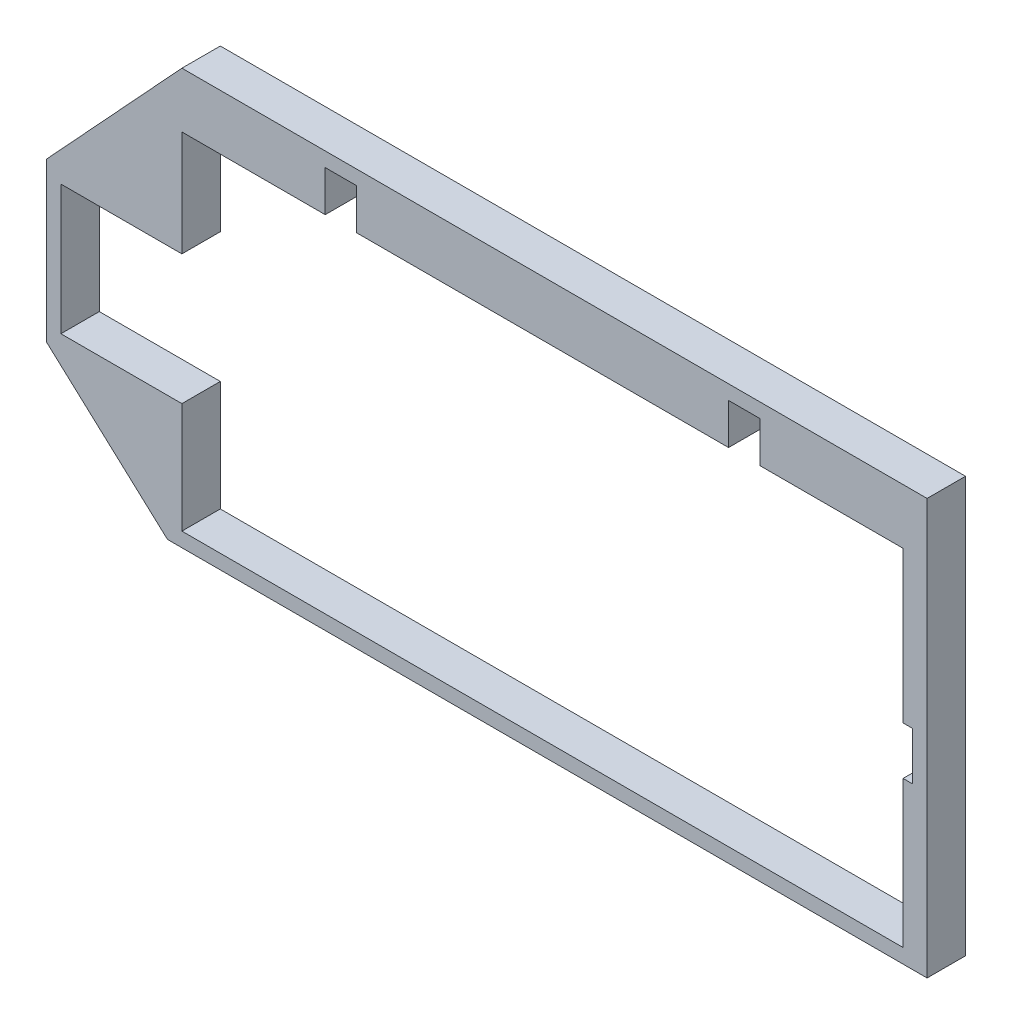
ISO-10303-21;
HEADER;
FILE_DESCRIPTION(('STEP AP214'),'2;1');
FILE_NAME('part.step','',(''),(''),'','','');
FILE_SCHEMA(('AUTOMOTIVE_DESIGN { 1 0 10303 214 1 1 1 1 }'));
ENDSEC;
DATA;
#1=APPLICATION_CONTEXT('core data for automotive mechanical design processes');
#2=APPLICATION_PROTOCOL_DEFINITION('international standard','automotive_design',2000,#1);
#3=PRODUCT_CONTEXT('',#1,'mechanical');
#4=PRODUCT('Part','Part','',(#3));
#5=PRODUCT_RELATED_PRODUCT_CATEGORY('part','',(#4));
#6=PRODUCT_DEFINITION_FORMATION('','',#4);
#7=PRODUCT_DEFINITION_CONTEXT('part definition',#1,'design');
#8=PRODUCT_DEFINITION('design','',#6,#7);
#9=PRODUCT_DEFINITION_SHAPE('','',#8);
#10=(LENGTH_UNIT() NAMED_UNIT(*) SI_UNIT(.MILLI.,.METRE.));
#11=(NAMED_UNIT(*) PLANE_ANGLE_UNIT() SI_UNIT($,.RADIAN.));
#12=(NAMED_UNIT(*) SI_UNIT($,.STERADIAN.) SOLID_ANGLE_UNIT());
#13=UNCERTAINTY_MEASURE_WITH_UNIT(LENGTH_MEASURE(1.E-05),#10,'distance_accuracy_value','');
#14=(GEOMETRIC_REPRESENTATION_CONTEXT(3) GLOBAL_UNCERTAINTY_ASSIGNED_CONTEXT((#13)) GLOBAL_UNIT_ASSIGNED_CONTEXT((#10,
#11,#12)) REPRESENTATION_CONTEXT('',''));
#15=CARTESIAN_POINT('',(0.,0.,0.));
#16=DIRECTION('',(0.,0.,1.));
#17=DIRECTION('',(1.,0.,0.));
#18=AXIS2_PLACEMENT_3D('',#15,#16,#17);
#19=CARTESIAN_POINT('',(0.,0.,8.));
#20=DIRECTION('',(0.,0.,1.));
#21=DIRECTION('',(1.,0.,0.));
#22=AXIS2_PLACEMENT_3D('',#19,#20,#21);
#23=PLANE('',#22);
#24=DIRECTION('',(-1.,0.,0.));
#25=VECTOR('',#24,1.);
#26=CARTESIAN_POINT('',(-150.2,83.5,8.));
#27=LINE('',#26,#25);
#28=CARTESIAN_POINT('',(5.,83.5,8.));
#29=VERTEX_POINT('',#28);
#30=CARTESIAN_POINT('',(-150.2,83.5,8.));
#31=VERTEX_POINT('',#30);
#32=EDGE_CURVE('E361',#29,#31,#27,.T.);
#33=ORIENTED_EDGE('',*,*,#32,.T.);
#34=DIRECTION('',(-0.678879797641086,-0.734249426526707,0.));
#35=VECTOR('',#34,1.);
#36=CARTESIAN_POINT('',(-178.4,53.,8.));
#37=LINE('',#36,#35);
#38=CARTESIAN_POINT('',(-178.4,53.,8.));
#39=VERTEX_POINT('',#38);
#40=EDGE_CURVE('E364',#31,#39,#37,.T.);
#41=ORIENTED_EDGE('',*,*,#40,.T.);
#42=DIRECTION('',(0.,-1.,0.));
#43=VECTOR('',#42,1.);
#44=CARTESIAN_POINT('',(-178.4,20.,8.));
#45=LINE('',#44,#43);
#46=CARTESIAN_POINT('',(-178.4,20.,8.));
#47=VERTEX_POINT('',#46);
#48=EDGE_CURVE('E367',#39,#47,#45,.T.);
#49=ORIENTED_EDGE('',*,*,#48,.T.);
#50=DIRECTION('',(0.738612390192779,-0.67413035612833,0.));
#51=VECTOR('',#50,1.);
#52=CARTESIAN_POINT('',(-178.4,20.,8.));
#53=LINE('',#52,#51);
#54=CARTESIAN_POINT('',(-153.2,-3.00000000000002,8.));
#55=VERTEX_POINT('',#54);
#56=EDGE_CURVE('E369',#47,#55,#53,.T.);
#57=ORIENTED_EDGE('',*,*,#56,.T.);
#58=DIRECTION('',(1.,0.,0.));
#59=VECTOR('',#58,1.);
#60=CARTESIAN_POINT('',(5.,-3.,8.));
#61=LINE('',#60,#59);
#62=CARTESIAN_POINT('',(5.,-3.,8.));
#63=VERTEX_POINT('',#62);
#64=EDGE_CURVE('E371',#55,#63,#61,.T.);
#65=ORIENTED_EDGE('',*,*,#64,.T.);
#66=DIRECTION('',(0.,1.,0.));
#67=VECTOR('',#66,1.);
#68=CARTESIAN_POINT('',(5.,-3.,8.));
#69=LINE('',#68,#67);
#70=EDGE_CURVE('E373',#63,#29,#69,.T.);
#71=ORIENTED_EDGE('',*,*,#70,.T.);
#72=EDGE_LOOP('',(#33,#41,#49,#57,#65,#71));
#73=FACE_BOUND('',#72,.T.);
#74=DIRECTION('',(-1.,0.,0.));
#75=VECTOR('',#74,1.);
#76=CARTESIAN_POINT('',(-150.2,50.,8.));
#77=LINE('',#76,#75);
#78=CARTESIAN_POINT('',(-150.2,50.,8.));
#79=VERTEX_POINT('',#78);
#80=CARTESIAN_POINT('',(-175.4,50.,8.));
#81=VERTEX_POINT('',#80);
#82=EDGE_CURVE('E220',#79,#81,#77,.T.);
#83=ORIENTED_EDGE('',*,*,#82,.F.);
#84=DIRECTION('',(0.,-1.,0.));
#85=VECTOR('',#84,1.);
#86=CARTESIAN_POINT('',(-150.2,72.,8.));
#87=LINE('',#86,#85);
#88=CARTESIAN_POINT('',(-150.2,72.,8.));
#89=VERTEX_POINT('',#88);
#90=EDGE_CURVE('E212',#89,#79,#87,.T.);
#91=ORIENTED_EDGE('',*,*,#90,.F.);
#92=DIRECTION('',(-1.,0.,0.));
#93=VECTOR('',#92,1.);
#94=CARTESIAN_POINT('',(-150.2,72.,8.));
#95=LINE('',#94,#93);
#96=CARTESIAN_POINT('',(-120.35,72.,8.));
#97=VERTEX_POINT('',#96);
#98=EDGE_CURVE('E269',#97,#89,#95,.T.);
#99=ORIENTED_EDGE('',*,*,#98,.F.);
#100=DIRECTION('',(0.,-1.,0.));
#101=VECTOR('',#100,1.);
#102=CARTESIAN_POINT('',(-120.35,72.,8.));
#103=LINE('',#102,#101);
#104=CARTESIAN_POINT('',(-120.35,80.5,8.));
#105=VERTEX_POINT('',#104);
#106=EDGE_CURVE('E267',#105,#97,#103,.T.);
#107=ORIENTED_EDGE('',*,*,#106,.F.);
#108=DIRECTION('',(-1.,0.,0.));
#109=VECTOR('',#108,1.);
#110=CARTESIAN_POINT('',(-113.85,80.5,8.));
#111=LINE('',#110,#109);
#112=CARTESIAN_POINT('',(-113.85,80.5,8.));
#113=VERTEX_POINT('',#112);
#114=EDGE_CURVE('E265',#113,#105,#111,.T.);
#115=ORIENTED_EDGE('',*,*,#114,.F.);
#116=DIRECTION('',(0.,1.,0.));
#117=VECTOR('',#116,1.);
#118=CARTESIAN_POINT('',(-113.85,72.,8.));
#119=LINE('',#118,#117);
#120=CARTESIAN_POINT('',(-113.85,72.,8.));
#121=VERTEX_POINT('',#120);
#122=EDGE_CURVE('E263',#121,#113,#119,.T.);
#123=ORIENTED_EDGE('',*,*,#122,.F.);
#124=DIRECTION('',(-1.,0.,0.));
#125=VECTOR('',#124,1.);
#126=CARTESIAN_POINT('',(-113.85,72.,8.));
#127=LINE('',#126,#125);
#128=CARTESIAN_POINT('',(-36.35,72.,8.));
#129=VERTEX_POINT('',#128);
#130=EDGE_CURVE('E261',#129,#121,#127,.T.);
#131=ORIENTED_EDGE('',*,*,#130,.F.);
#132=DIRECTION('',(0.,-1.,0.));
#133=VECTOR('',#132,1.);
#134=CARTESIAN_POINT('',(-36.35,72.,8.));
#135=LINE('',#134,#133);
#136=CARTESIAN_POINT('',(-36.35,80.5,8.));
#137=VERTEX_POINT('',#136);
#138=EDGE_CURVE('E259',#137,#129,#135,.T.);
#139=ORIENTED_EDGE('',*,*,#138,.F.);
#140=DIRECTION('',(-1.,0.,0.));
#141=VECTOR('',#140,1.);
#142=CARTESIAN_POINT('',(-29.85,80.5,8.));
#143=LINE('',#142,#141);
#144=CARTESIAN_POINT('',(-29.85,80.5,8.));
#145=VERTEX_POINT('',#144);
#146=EDGE_CURVE('E257',#145,#137,#143,.T.);
#147=ORIENTED_EDGE('',*,*,#146,.F.);
#148=DIRECTION('',(0.,1.,0.));
#149=VECTOR('',#148,1.);
#150=CARTESIAN_POINT('',(-29.85,72.,8.));
#151=LINE('',#150,#149);
#152=CARTESIAN_POINT('',(-29.85,72.,8.));
#153=VERTEX_POINT('',#152);
#154=EDGE_CURVE('E255',#153,#145,#151,.T.);
#155=ORIENTED_EDGE('',*,*,#154,.F.);
#156=DIRECTION('',(-1.,0.,0.));
#157=VECTOR('',#156,1.);
#158=CARTESIAN_POINT('',(-29.85,72.,8.));
#159=LINE('',#158,#157);
#160=CARTESIAN_POINT('',(0.,72.,8.));
#161=VERTEX_POINT('',#160);
#162=EDGE_CURVE('E253',#161,#153,#159,.T.);
#163=ORIENTED_EDGE('',*,*,#162,.F.);
#164=DIRECTION('',(0.,1.,0.));
#165=VECTOR('',#164,1.);
#166=CARTESIAN_POINT('',(0.,72.,8.));
#167=LINE('',#166,#165);
#168=CARTESIAN_POINT('',(0.,40.5,8.));
#169=VERTEX_POINT('',#168);
#170=EDGE_CURVE('E251',#169,#161,#167,.T.);
#171=ORIENTED_EDGE('',*,*,#170,.F.);
#172=DIRECTION('',(-1.,0.,0.));
#173=VECTOR('',#172,1.);
#174=CARTESIAN_POINT('',(0.,40.5,8.));
#175=LINE('',#174,#173);
#176=CARTESIAN_POINT('',(2.,40.5,8.));
#177=VERTEX_POINT('',#176);
#178=EDGE_CURVE('E249',#177,#169,#175,.T.);
#179=ORIENTED_EDGE('',*,*,#178,.F.);
#180=DIRECTION('',(0.,1.,0.));
#181=VECTOR('',#180,1.);
#182=CARTESIAN_POINT('',(2.,40.5,8.));
#183=LINE('',#182,#181);
#184=CARTESIAN_POINT('',(2.,30.5,8.));
#185=VERTEX_POINT('',#184);
#186=EDGE_CURVE('E247',#185,#177,#183,.T.);
#187=ORIENTED_EDGE('',*,*,#186,.F.);
#188=DIRECTION('',(1.,0.,0.));
#189=VECTOR('',#188,1.);
#190=CARTESIAN_POINT('',(0.,30.5,8.));
#191=LINE('',#190,#189);
#192=CARTESIAN_POINT('',(0.,30.5,8.));
#193=VERTEX_POINT('',#192);
#194=EDGE_CURVE('E245',#193,#185,#191,.T.);
#195=ORIENTED_EDGE('',*,*,#194,.F.);
#196=DIRECTION('',(0.,1.,0.));
#197=VECTOR('',#196,1.);
#198=CARTESIAN_POINT('',(0.,30.5,8.));
#199=LINE('',#198,#197);
#200=CARTESIAN_POINT('',(0.,0.,8.));
#201=VERTEX_POINT('',#200);
#202=EDGE_CURVE('E243',#201,#193,#199,.T.);
#203=ORIENTED_EDGE('',*,*,#202,.F.);
#204=DIRECTION('',(1.,0.,0.));
#205=VECTOR('',#204,1.);
#206=CARTESIAN_POINT('',(-150.2,0.,8.));
#207=LINE('',#206,#205);
#208=CARTESIAN_POINT('',(-150.2,0.,8.));
#209=VERTEX_POINT('',#208);
#210=EDGE_CURVE('E241',#209,#201,#207,.T.);
#211=ORIENTED_EDGE('',*,*,#210,.F.);
#212=DIRECTION('',(0.,-1.,0.));
#213=VECTOR('',#212,1.);
#214=CARTESIAN_POINT('',(-150.2,23.,8.));
#215=LINE('',#214,#213);
#216=CARTESIAN_POINT('',(-150.2,23.,8.));
#217=VERTEX_POINT('',#216);
#218=EDGE_CURVE('E239',#217,#209,#215,.T.);
#219=ORIENTED_EDGE('',*,*,#218,.F.);
#220=DIRECTION('',(1.,0.,0.));
#221=VECTOR('',#220,1.);
#222=CARTESIAN_POINT('',(-150.2,23.,8.));
#223=LINE('',#222,#221);
#224=CARTESIAN_POINT('',(-175.4,23.,8.));
#225=VERTEX_POINT('',#224);
#226=EDGE_CURVE('E235',#225,#217,#223,.T.);
#227=ORIENTED_EDGE('',*,*,#226,.F.);
#228=DIRECTION('',(0.,-1.,0.));
#229=VECTOR('',#228,1.);
#230=CARTESIAN_POINT('',(-175.4,50.,8.));
#231=LINE('',#230,#229);
#232=EDGE_CURVE('E233',#81,#225,#231,.T.);
#233=ORIENTED_EDGE('',*,*,#232,.F.);
#234=EDGE_LOOP('',(#83,#91,#99,#107,#115,#123,#131,#139,#147,#155,#163,#171,#179,#187,#195,#203,
#211,#219,#227,#233));
#235=FACE_BOUND('',#234,.T.);
#236=ADVANCED_FACE('F39',(#73,#235),#23,.T.);
#237=CARTESIAN_POINT('',(0.,0.,0.));
#238=DIRECTION('',(0.,0.,1.));
#239=DIRECTION('',(1.,0.,0.));
#240=AXIS2_PLACEMENT_3D('',#237,#238,#239);
#241=PLANE('',#240);
#242=DIRECTION('',(-1.,0.,0.));
#243=VECTOR('',#242,1.);
#244=CARTESIAN_POINT('',(-150.2,83.5,0.));
#245=LINE('',#244,#243);
#246=CARTESIAN_POINT('',(5.,83.5,0.));
#247=VERTEX_POINT('',#246);
#248=CARTESIAN_POINT('',(-150.2,83.5,0.));
#249=VERTEX_POINT('',#248);
#250=EDGE_CURVE('E228',#247,#249,#245,.T.);
#251=ORIENTED_EDGE('',*,*,#250,.F.);
#252=DIRECTION('',(0.,1.,0.));
#253=VECTOR('',#252,1.);
#254=CARTESIAN_POINT('',(5.,-3.,0.));
#255=LINE('',#254,#253);
#256=CARTESIAN_POINT('',(5.,-3.,0.));
#257=VERTEX_POINT('',#256);
#258=EDGE_CURVE('E365',#257,#247,#255,.T.);
#259=ORIENTED_EDGE('',*,*,#258,.F.);
#260=DIRECTION('',(1.,0.,0.));
#261=VECTOR('',#260,1.);
#262=CARTESIAN_POINT('',(5.,-3.,0.));
#263=LINE('',#262,#261);
#264=CARTESIAN_POINT('',(-153.2,-3.00000000000002,0.));
#265=VERTEX_POINT('',#264);
#266=EDGE_CURVE('E384',#265,#257,#263,.T.);
#267=ORIENTED_EDGE('',*,*,#266,.F.);
#268=DIRECTION('',(0.738612390192779,-0.67413035612833,0.));
#269=VECTOR('',#268,1.);
#270=CARTESIAN_POINT('',(-178.4,20.,0.));
#271=LINE('',#270,#269);
#272=CARTESIAN_POINT('',(-178.4,20.,0.));
#273=VERTEX_POINT('',#272);
#274=EDGE_CURVE('E382',#273,#265,#271,.T.);
#275=ORIENTED_EDGE('',*,*,#274,.F.);
#276=DIRECTION('',(0.,-1.,0.));
#277=VECTOR('',#276,1.);
#278=CARTESIAN_POINT('',(-178.4,20.,0.));
#279=LINE('',#278,#277);
#280=CARTESIAN_POINT('',(-178.4,53.,0.));
#281=VERTEX_POINT('',#280);
#282=EDGE_CURVE('E380',#281,#273,#279,.T.);
#283=ORIENTED_EDGE('',*,*,#282,.F.);
#284=DIRECTION('',(-0.678879797641086,-0.734249426526707,0.));
#285=VECTOR('',#284,1.);
#286=CARTESIAN_POINT('',(-178.4,53.,0.));
#287=LINE('',#286,#285);
#288=EDGE_CURVE('E378',#249,#281,#287,.T.);
#289=ORIENTED_EDGE('',*,*,#288,.F.);
#290=EDGE_LOOP('',(#251,#259,#267,#275,#283,#289));
#291=FACE_BOUND('',#290,.T.);
#292=DIRECTION('',(0.,-1.,0.));
#293=VECTOR('',#292,1.);
#294=CARTESIAN_POINT('',(-150.2,72.,0.));
#295=LINE('',#294,#293);
#296=CARTESIAN_POINT('',(-150.2,72.,0.));
#297=VERTEX_POINT('',#296);
#298=CARTESIAN_POINT('',(-150.2,50.,0.));
#299=VERTEX_POINT('',#298);
#300=EDGE_CURVE('E62',#297,#299,#295,.T.);
#301=ORIENTED_EDGE('',*,*,#300,.T.);
#302=DIRECTION('',(-1.,0.,0.));
#303=VECTOR('',#302,1.);
#304=CARTESIAN_POINT('',(-150.2,50.,0.));
#305=LINE('',#304,#303);
#306=CARTESIAN_POINT('',(-175.4,50.,0.));
#307=VERTEX_POINT('',#306);
#308=EDGE_CURVE('E227',#299,#307,#305,.T.);
#309=ORIENTED_EDGE('',*,*,#308,.T.);
#310=DIRECTION('',(0.,-1.,0.));
#311=VECTOR('',#310,1.);
#312=CARTESIAN_POINT('',(-175.4,50.,0.));
#313=LINE('',#312,#311);
#314=CARTESIAN_POINT('',(-175.4,23.,0.));
#315=VERTEX_POINT('',#314);
#316=EDGE_CURVE('E273',#307,#315,#313,.T.);
#317=ORIENTED_EDGE('',*,*,#316,.T.);
#318=DIRECTION('',(1.,0.,0.));
#319=VECTOR('',#318,1.);
#320=CARTESIAN_POINT('',(-150.2,23.,0.));
#321=LINE('',#320,#319);
#322=CARTESIAN_POINT('',(-150.2,23.,0.));
#323=VERTEX_POINT('',#322);
#324=EDGE_CURVE('E276',#315,#323,#321,.T.);
#325=ORIENTED_EDGE('',*,*,#324,.T.);
#326=DIRECTION('',(0.,-1.,0.));
#327=VECTOR('',#326,1.);
#328=CARTESIAN_POINT('',(-150.2,23.,0.));
#329=LINE('',#328,#327);
#330=CARTESIAN_POINT('',(-150.2,0.,0.));
#331=VERTEX_POINT('',#330);
#332=EDGE_CURVE('E279',#323,#331,#329,.T.);
#333=ORIENTED_EDGE('',*,*,#332,.T.);
#334=DIRECTION('',(1.,0.,0.));
#335=VECTOR('',#334,1.);
#336=CARTESIAN_POINT('',(-150.2,0.,0.));
#337=LINE('',#336,#335);
#338=CARTESIAN_POINT('',(0.,0.,0.));
#339=VERTEX_POINT('',#338);
#340=EDGE_CURVE('E282',#331,#339,#337,.T.);
#341=ORIENTED_EDGE('',*,*,#340,.T.);
#342=DIRECTION('',(0.,1.,0.));
#343=VECTOR('',#342,1.);
#344=CARTESIAN_POINT('',(0.,30.5,0.));
#345=LINE('',#344,#343);
#346=CARTESIAN_POINT('',(0.,30.5,0.));
#347=VERTEX_POINT('',#346);
#348=EDGE_CURVE('E285',#339,#347,#345,.T.);
#349=ORIENTED_EDGE('',*,*,#348,.T.);
#350=DIRECTION('',(1.,0.,0.));
#351=VECTOR('',#350,1.);
#352=CARTESIAN_POINT('',(0.,30.5,0.));
#353=LINE('',#352,#351);
#354=CARTESIAN_POINT('',(2.,30.5,0.));
#355=VERTEX_POINT('',#354);
#356=EDGE_CURVE('E288',#347,#355,#353,.T.);
#357=ORIENTED_EDGE('',*,*,#356,.T.);
#358=DIRECTION('',(0.,1.,0.));
#359=VECTOR('',#358,1.);
#360=CARTESIAN_POINT('',(2.,40.5,0.));
#361=LINE('',#360,#359);
#362=CARTESIAN_POINT('',(2.,40.5,0.));
#363=VERTEX_POINT('',#362);
#364=EDGE_CURVE('E291',#355,#363,#361,.T.);
#365=ORIENTED_EDGE('',*,*,#364,.T.);
#366=DIRECTION('',(-1.,0.,0.));
#367=VECTOR('',#366,1.);
#368=CARTESIAN_POINT('',(0.,40.5,0.));
#369=LINE('',#368,#367);
#370=CARTESIAN_POINT('',(0.,40.5,0.));
#371=VERTEX_POINT('',#370);
#372=EDGE_CURVE('E294',#363,#371,#369,.T.);
#373=ORIENTED_EDGE('',*,*,#372,.T.);
#374=DIRECTION('',(0.,1.,0.));
#375=VECTOR('',#374,1.);
#376=CARTESIAN_POINT('',(0.,72.,0.));
#377=LINE('',#376,#375);
#378=CARTESIAN_POINT('',(0.,72.,0.));
#379=VERTEX_POINT('',#378);
#380=EDGE_CURVE('E297',#371,#379,#377,.T.);
#381=ORIENTED_EDGE('',*,*,#380,.T.);
#382=DIRECTION('',(-1.,0.,0.));
#383=VECTOR('',#382,1.);
#384=CARTESIAN_POINT('',(-29.85,72.,0.));
#385=LINE('',#384,#383);
#386=CARTESIAN_POINT('',(-29.85,72.,0.));
#387=VERTEX_POINT('',#386);
#388=EDGE_CURVE('E300',#379,#387,#385,.T.);
#389=ORIENTED_EDGE('',*,*,#388,.T.);
#390=DIRECTION('',(0.,1.,0.));
#391=VECTOR('',#390,1.);
#392=CARTESIAN_POINT('',(-29.85,72.,0.));
#393=LINE('',#392,#391);
#394=CARTESIAN_POINT('',(-29.85,80.5,0.));
#395=VERTEX_POINT('',#394);
#396=EDGE_CURVE('E303',#387,#395,#393,.T.);
#397=ORIENTED_EDGE('',*,*,#396,.T.);
#398=DIRECTION('',(-1.,0.,0.));
#399=VECTOR('',#398,1.);
#400=CARTESIAN_POINT('',(-29.85,80.5,0.));
#401=LINE('',#400,#399);
#402=CARTESIAN_POINT('',(-36.35,80.5,0.));
#403=VERTEX_POINT('',#402);
#404=EDGE_CURVE('E306',#395,#403,#401,.T.);
#405=ORIENTED_EDGE('',*,*,#404,.T.);
#406=DIRECTION('',(0.,-1.,0.));
#407=VECTOR('',#406,1.);
#408=CARTESIAN_POINT('',(-36.35,72.,0.));
#409=LINE('',#408,#407);
#410=CARTESIAN_POINT('',(-36.35,72.,0.));
#411=VERTEX_POINT('',#410);
#412=EDGE_CURVE('E309',#403,#411,#409,.T.);
#413=ORIENTED_EDGE('',*,*,#412,.T.);
#414=DIRECTION('',(-1.,0.,0.));
#415=VECTOR('',#414,1.);
#416=CARTESIAN_POINT('',(-113.85,72.,0.));
#417=LINE('',#416,#415);
#418=CARTESIAN_POINT('',(-113.85,72.,0.));
#419=VERTEX_POINT('',#418);
#420=EDGE_CURVE('E312',#411,#419,#417,.T.);
#421=ORIENTED_EDGE('',*,*,#420,.T.);
#422=DIRECTION('',(0.,1.,0.));
#423=VECTOR('',#422,1.);
#424=CARTESIAN_POINT('',(-113.85,72.,0.));
#425=LINE('',#424,#423);
#426=CARTESIAN_POINT('',(-113.85,80.5,0.));
#427=VERTEX_POINT('',#426);
#428=EDGE_CURVE('E315',#419,#427,#425,.T.);
#429=ORIENTED_EDGE('',*,*,#428,.T.);
#430=DIRECTION('',(-1.,0.,0.));
#431=VECTOR('',#430,1.);
#432=CARTESIAN_POINT('',(-113.85,80.5,0.));
#433=LINE('',#432,#431);
#434=CARTESIAN_POINT('',(-120.35,80.5,0.));
#435=VERTEX_POINT('',#434);
#436=EDGE_CURVE('E318',#427,#435,#433,.T.);
#437=ORIENTED_EDGE('',*,*,#436,.T.);
#438=DIRECTION('',(0.,-1.,0.));
#439=VECTOR('',#438,1.);
#440=CARTESIAN_POINT('',(-120.35,72.,0.));
#441=LINE('',#440,#439);
#442=CARTESIAN_POINT('',(-120.35,72.,0.));
#443=VERTEX_POINT('',#442);
#444=EDGE_CURVE('E321',#435,#443,#441,.T.);
#445=ORIENTED_EDGE('',*,*,#444,.T.);
#446=DIRECTION('',(-1.,0.,0.));
#447=VECTOR('',#446,1.);
#448=CARTESIAN_POINT('',(-150.2,72.,0.));
#449=LINE('',#448,#447);
#450=EDGE_CURVE('E221',#443,#297,#449,.T.);
#451=ORIENTED_EDGE('',*,*,#450,.T.);
#452=EDGE_LOOP('',(#301,#309,#317,#325,#333,#341,#349,#357,#365,#373,#381,#389,#397,#405,#413,
#421,#429,#437,#445,#451));
#453=FACE_BOUND('',#452,.T.);
#454=ADVANCED_FACE('F408',(#291,#453),#241,.F.);
#455=CARTESIAN_POINT('',(-150.2,83.5,8.));
#456=DIRECTION('',(0.,-1.,0.));
#457=DIRECTION('',(0.,0.,-1.));
#458=AXIS2_PLACEMENT_3D('',#455,#456,#457);
#459=PLANE('',#458);
#460=ORIENTED_EDGE('',*,*,#250,.T.);
#461=DIRECTION('',(0.,0.,-1.));
#462=VECTOR('',#461,1.);
#463=CARTESIAN_POINT('',(-150.2,83.5,8.));
#464=LINE('',#463,#462);
#465=EDGE_CURVE('E11',#31,#249,#464,.T.);
#466=ORIENTED_EDGE('',*,*,#465,.F.);
#467=ORIENTED_EDGE('',*,*,#32,.F.);
#468=DIRECTION('',(0.,0.,-1.));
#469=VECTOR('',#468,1.);
#470=CARTESIAN_POINT('',(5.,83.5,8.));
#471=LINE('',#470,#469);
#472=EDGE_CURVE('E375',#29,#247,#471,.T.);
#473=ORIENTED_EDGE('',*,*,#472,.T.);
#474=EDGE_LOOP('',(#460,#466,#467,#473));
#475=FACE_BOUND('',#474,.T.);
#476=ADVANCED_FACE('F41',(#475),#459,.F.);
#477=CARTESIAN_POINT('',(-178.4,53.,8.));
#478=DIRECTION('',(0.734249426526707,-0.678879797641086,0.));
#479=DIRECTION('',(0.678879797641086,0.734249426526707,0.));
#480=AXIS2_PLACEMENT_3D('',#477,#478,#479);
#481=PLANE('',#480);
#482=ORIENTED_EDGE('',*,*,#288,.T.);
#483=DIRECTION('',(0.,0.,-1.));
#484=VECTOR('',#483,1.);
#485=CARTESIAN_POINT('',(-178.4,53.,8.));
#486=LINE('',#485,#484);
#487=EDGE_CURVE('E47',#39,#281,#486,.T.);
#488=ORIENTED_EDGE('',*,*,#487,.F.);
#489=ORIENTED_EDGE('',*,*,#40,.F.);
#490=ORIENTED_EDGE('',*,*,#465,.T.);
#491=EDGE_LOOP('',(#482,#488,#489,#490));
#492=FACE_BOUND('',#491,.T.);
#493=ADVANCED_FACE('F425',(#492),#481,.F.);
#494=CARTESIAN_POINT('',(-178.4,20.,8.));
#495=DIRECTION('',(1.,0.,0.));
#496=DIRECTION('',(0.,0.,-1.));
#497=AXIS2_PLACEMENT_3D('',#494,#495,#496);
#498=PLANE('',#497);
#499=ORIENTED_EDGE('',*,*,#282,.T.);
#500=DIRECTION('',(0.,0.,-1.));
#501=VECTOR('',#500,1.);
#502=CARTESIAN_POINT('',(-178.4,20.,8.));
#503=LINE('',#502,#501);
#504=EDGE_CURVE('E395',#47,#273,#503,.T.);
#505=ORIENTED_EDGE('',*,*,#504,.F.);
#506=ORIENTED_EDGE('',*,*,#48,.F.);
#507=ORIENTED_EDGE('',*,*,#487,.T.);
#508=EDGE_LOOP('',(#499,#505,#506,#507));
#509=FACE_BOUND('',#508,.T.);
#510=ADVANCED_FACE('F402',(#509),#498,.F.);
#511=CARTESIAN_POINT('',(-178.4,20.,8.));
#512=DIRECTION('',(0.67413035612833,0.738612390192779,0.));
#513=DIRECTION('',(-0.738612390192779,0.67413035612833,0.));
#514=AXIS2_PLACEMENT_3D('',#511,#512,#513);
#515=PLANE('',#514);
#516=ORIENTED_EDGE('',*,*,#274,.T.);
#517=DIRECTION('',(0.,0.,-1.));
#518=VECTOR('',#517,1.);
#519=CARTESIAN_POINT('',(-153.2,-3.00000000000002,8.));
#520=LINE('',#519,#518);
#521=EDGE_CURVE('E392',#55,#265,#520,.T.);
#522=ORIENTED_EDGE('',*,*,#521,.F.);
#523=ORIENTED_EDGE('',*,*,#56,.F.);
#524=ORIENTED_EDGE('',*,*,#504,.T.);
#525=EDGE_LOOP('',(#516,#522,#523,#524));
#526=FACE_BOUND('',#525,.T.);
#527=ADVANCED_FACE('F414',(#526),#515,.F.);
#528=CARTESIAN_POINT('',(5.,-3.,8.));
#529=DIRECTION('',(0.,1.,0.));
#530=DIRECTION('',(-1.,0.,0.));
#531=AXIS2_PLACEMENT_3D('',#528,#529,#530);
#532=PLANE('',#531);
#533=ORIENTED_EDGE('',*,*,#266,.T.);
#534=DIRECTION('',(0.,0.,-1.));
#535=VECTOR('',#534,1.);
#536=CARTESIAN_POINT('',(5.,-3.,8.));
#537=LINE('',#536,#535);
#538=EDGE_CURVE('E389',#63,#257,#537,.T.);
#539=ORIENTED_EDGE('',*,*,#538,.F.);
#540=ORIENTED_EDGE('',*,*,#64,.F.);
#541=ORIENTED_EDGE('',*,*,#521,.T.);
#542=EDGE_LOOP('',(#533,#539,#540,#541));
#543=FACE_BOUND('',#542,.T.);
#544=ADVANCED_FACE('F418',(#543),#532,.F.);
#545=CARTESIAN_POINT('',(5.,-3.,8.));
#546=DIRECTION('',(-1.,0.,0.));
#547=DIRECTION('',(0.,0.,1.));
#548=AXIS2_PLACEMENT_3D('',#545,#546,#547);
#549=PLANE('',#548);
#550=ORIENTED_EDGE('',*,*,#258,.T.);
#551=ORIENTED_EDGE('',*,*,#472,.F.);
#552=ORIENTED_EDGE('',*,*,#70,.F.);
#553=ORIENTED_EDGE('',*,*,#538,.T.);
#554=EDGE_LOOP('',(#550,#551,#552,#553));
#555=FACE_BOUND('',#554,.T.);
#556=ADVANCED_FACE('F428',(#555),#549,.F.);
#557=CARTESIAN_POINT('',(-150.2,72.,8.));
#558=DIRECTION('',(1.,0.,0.));
#559=DIRECTION('',(0.,0.,-1.));
#560=AXIS2_PLACEMENT_3D('',#557,#558,#559);
#561=PLANE('',#560);
#562=ORIENTED_EDGE('',*,*,#300,.F.);
#563=DIRECTION('',(0.,0.,-1.));
#564=VECTOR('',#563,1.);
#565=CARTESIAN_POINT('',(-150.2,72.,8.));
#566=LINE('',#565,#564);
#567=EDGE_CURVE('E216',#89,#297,#566,.T.);
#568=ORIENTED_EDGE('',*,*,#567,.F.);
#569=ORIENTED_EDGE('',*,*,#90,.T.);
#570=DIRECTION('',(0.,0.,-1.));
#571=VECTOR('',#570,1.);
#572=CARTESIAN_POINT('',(-150.2,50.,8.));
#573=LINE('',#572,#571);
#574=EDGE_CURVE('E215',#79,#299,#573,.T.);
#575=ORIENTED_EDGE('',*,*,#574,.T.);
#576=EDGE_LOOP('',(#562,#568,#569,#575));
#577=FACE_BOUND('',#576,.T.);
#578=ADVANCED_FACE('F214',(#577),#561,.T.);
#579=CARTESIAN_POINT('',(-150.2,50.,8.));
#580=DIRECTION('',(0.,-1.,0.));
#581=DIRECTION('',(0.,0.,-1.));
#582=AXIS2_PLACEMENT_3D('',#579,#580,#581);
#583=PLANE('',#582);
#584=ORIENTED_EDGE('',*,*,#308,.F.);
#585=ORIENTED_EDGE('',*,*,#574,.F.);
#586=ORIENTED_EDGE('',*,*,#82,.T.);
#587=DIRECTION('',(0.,0.,-1.));
#588=VECTOR('',#587,1.);
#589=CARTESIAN_POINT('',(-175.4,50.,8.));
#590=LINE('',#589,#588);
#591=EDGE_CURVE('E229',#81,#307,#590,.T.);
#592=ORIENTED_EDGE('',*,*,#591,.T.);
#593=EDGE_LOOP('',(#584,#585,#586,#592));
#594=FACE_BOUND('',#593,.T.);
#595=ADVANCED_FACE('F224',(#594),#583,.T.);
#596=CARTESIAN_POINT('',(-175.4,50.,8.));
#597=DIRECTION('',(1.,0.,0.));
#598=DIRECTION('',(0.,0.,-1.));
#599=AXIS2_PLACEMENT_3D('',#596,#597,#598);
#600=PLANE('',#599);
#601=ORIENTED_EDGE('',*,*,#316,.F.);
#602=ORIENTED_EDGE('',*,*,#591,.F.);
#603=ORIENTED_EDGE('',*,*,#232,.T.);
#604=DIRECTION('',(0.,0.,-1.));
#605=VECTOR('',#604,1.);
#606=CARTESIAN_POINT('',(-175.4,23.,8.));
#607=LINE('',#606,#605);
#608=EDGE_CURVE('E358',#225,#315,#607,.T.);
#609=ORIENTED_EDGE('',*,*,#608,.T.);
#610=EDGE_LOOP('',(#601,#602,#603,#609));
#611=FACE_BOUND('',#610,.T.);
#612=ADVANCED_FACE('F446',(#611),#600,.T.);
#613=CARTESIAN_POINT('',(-150.2,23.,8.));
#614=DIRECTION('',(0.,1.,0.));
#615=DIRECTION('',(-1.,0.,0.));
#616=AXIS2_PLACEMENT_3D('',#613,#614,#615);
#617=PLANE('',#616);
#618=ORIENTED_EDGE('',*,*,#324,.F.);
#619=ORIENTED_EDGE('',*,*,#608,.F.);
#620=ORIENTED_EDGE('',*,*,#226,.T.);
#621=DIRECTION('',(0.,0.,-1.));
#622=VECTOR('',#621,1.);
#623=CARTESIAN_POINT('',(-150.2,23.,8.));
#624=LINE('',#623,#622);
#625=EDGE_CURVE('E356',#217,#323,#624,.T.);
#626=ORIENTED_EDGE('',*,*,#625,.T.);
#627=EDGE_LOOP('',(#618,#619,#620,#626));
#628=FACE_BOUND('',#627,.T.);
#629=ADVANCED_FACE('F449',(#628),#617,.T.);
#630=CARTESIAN_POINT('',(-150.2,23.,8.));
#631=DIRECTION('',(1.,0.,0.));
#632=DIRECTION('',(0.,0.,-1.));
#633=AXIS2_PLACEMENT_3D('',#630,#631,#632);
#634=PLANE('',#633);
#635=ORIENTED_EDGE('',*,*,#332,.F.);
#636=ORIENTED_EDGE('',*,*,#625,.F.);
#637=ORIENTED_EDGE('',*,*,#218,.T.);
#638=DIRECTION('',(0.,0.,-1.));
#639=VECTOR('',#638,1.);
#640=CARTESIAN_POINT('',(-150.2,0.,8.));
#641=LINE('',#640,#639);
#642=EDGE_CURVE('E354',#209,#331,#641,.T.);
#643=ORIENTED_EDGE('',*,*,#642,.T.);
#644=EDGE_LOOP('',(#635,#636,#637,#643));
#645=FACE_BOUND('',#644,.T.);
#646=ADVANCED_FACE('F453',(#645),#634,.T.);
#647=CARTESIAN_POINT('',(-150.2,0.,8.));
#648=DIRECTION('',(0.,1.,0.));
#649=DIRECTION('',(0.,0.,1.));
#650=AXIS2_PLACEMENT_3D('',#647,#648,#649);
#651=PLANE('',#650);
#652=ORIENTED_EDGE('',*,*,#340,.F.);
#653=ORIENTED_EDGE('',*,*,#642,.F.);
#654=ORIENTED_EDGE('',*,*,#210,.T.);
#655=DIRECTION('',(0.,0.,-1.));
#656=VECTOR('',#655,1.);
#657=CARTESIAN_POINT('',(0.,0.,8.));
#658=LINE('',#657,#656);
#659=EDGE_CURVE('E352',#201,#339,#658,.T.);
#660=ORIENTED_EDGE('',*,*,#659,.T.);
#661=EDGE_LOOP('',(#652,#653,#654,#660));
#662=FACE_BOUND('',#661,.T.);
#663=ADVANCED_FACE('F457',(#662),#651,.T.);
#664=CARTESIAN_POINT('',(0.,30.5,8.));
#665=DIRECTION('',(-1.,0.,0.));
#666=DIRECTION('',(0.,-1.,0.));
#667=AXIS2_PLACEMENT_3D('',#664,#665,#666);
#668=PLANE('',#667);
#669=ORIENTED_EDGE('',*,*,#348,.F.);
#670=ORIENTED_EDGE('',*,*,#659,.F.);
#671=ORIENTED_EDGE('',*,*,#202,.T.);
#672=DIRECTION('',(0.,0.,-1.));
#673=VECTOR('',#672,1.);
#674=CARTESIAN_POINT('',(0.,30.5,8.));
#675=LINE('',#674,#673);
#676=EDGE_CURVE('E350',#193,#347,#675,.T.);
#677=ORIENTED_EDGE('',*,*,#676,.T.);
#678=EDGE_LOOP('',(#669,#670,#671,#677));
#679=FACE_BOUND('',#678,.T.);
#680=ADVANCED_FACE('F461',(#679),#668,.T.);
#681=CARTESIAN_POINT('',(0.,30.5,8.));
#682=DIRECTION('',(0.,1.,0.));
#683=DIRECTION('',(0.,0.,1.));
#684=AXIS2_PLACEMENT_3D('',#681,#682,#683);
#685=PLANE('',#684);
#686=ORIENTED_EDGE('',*,*,#356,.F.);
#687=ORIENTED_EDGE('',*,*,#676,.F.);
#688=ORIENTED_EDGE('',*,*,#194,.T.);
#689=DIRECTION('',(0.,0.,-1.));
#690=VECTOR('',#689,1.);
#691=CARTESIAN_POINT('',(2.,30.5,8.));
#692=LINE('',#691,#690);
#693=EDGE_CURVE('E348',#185,#355,#692,.T.);
#694=ORIENTED_EDGE('',*,*,#693,.T.);
#695=EDGE_LOOP('',(#686,#687,#688,#694));
#696=FACE_BOUND('',#695,.T.);
#697=ADVANCED_FACE('F465',(#696),#685,.T.);
#698=CARTESIAN_POINT('',(2.,40.5,8.));
#699=DIRECTION('',(-1.,0.,0.));
#700=DIRECTION('',(0.,-1.,0.));
#701=AXIS2_PLACEMENT_3D('',#698,#699,#700);
#702=PLANE('',#701);
#703=ORIENTED_EDGE('',*,*,#364,.F.);
#704=ORIENTED_EDGE('',*,*,#693,.F.);
#705=ORIENTED_EDGE('',*,*,#186,.T.);
#706=DIRECTION('',(0.,0.,-1.));
#707=VECTOR('',#706,1.);
#708=CARTESIAN_POINT('',(2.,40.5,8.));
#709=LINE('',#708,#707);
#710=EDGE_CURVE('E346',#177,#363,#709,.T.);
#711=ORIENTED_EDGE('',*,*,#710,.T.);
#712=EDGE_LOOP('',(#703,#704,#705,#711));
#713=FACE_BOUND('',#712,.T.);
#714=ADVANCED_FACE('F469',(#713),#702,.T.);
#715=CARTESIAN_POINT('',(0.,40.5,8.));
#716=DIRECTION('',(0.,-1.,0.));
#717=DIRECTION('',(1.,0.,0.));
#718=AXIS2_PLACEMENT_3D('',#715,#716,#717);
#719=PLANE('',#718);
#720=ORIENTED_EDGE('',*,*,#372,.F.);
#721=ORIENTED_EDGE('',*,*,#710,.F.);
#722=ORIENTED_EDGE('',*,*,#178,.T.);
#723=DIRECTION('',(0.,0.,-1.));
#724=VECTOR('',#723,1.);
#725=CARTESIAN_POINT('',(0.,40.5,8.));
#726=LINE('',#725,#724);
#727=EDGE_CURVE('E344',#169,#371,#726,.T.);
#728=ORIENTED_EDGE('',*,*,#727,.T.);
#729=EDGE_LOOP('',(#720,#721,#722,#728));
#730=FACE_BOUND('',#729,.T.);
#731=ADVANCED_FACE('F473',(#730),#719,.T.);
#732=CARTESIAN_POINT('',(0.,72.,8.));
#733=DIRECTION('',(-1.,0.,0.));
#734=DIRECTION('',(0.,-1.,0.));
#735=AXIS2_PLACEMENT_3D('',#732,#733,#734);
#736=PLANE('',#735);
#737=ORIENTED_EDGE('',*,*,#380,.F.);
#738=ORIENTED_EDGE('',*,*,#727,.F.);
#739=ORIENTED_EDGE('',*,*,#170,.T.);
#740=DIRECTION('',(0.,0.,-1.));
#741=VECTOR('',#740,1.);
#742=CARTESIAN_POINT('',(0.,72.,8.));
#743=LINE('',#742,#741);
#744=EDGE_CURVE('E342',#161,#379,#743,.T.);
#745=ORIENTED_EDGE('',*,*,#744,.T.);
#746=EDGE_LOOP('',(#737,#738,#739,#745));
#747=FACE_BOUND('',#746,.T.);
#748=ADVANCED_FACE('F477',(#747),#736,.T.);
#749=CARTESIAN_POINT('',(-29.85,72.,8.));
#750=DIRECTION('',(0.,-1.,0.));
#751=DIRECTION('',(1.,0.,0.));
#752=AXIS2_PLACEMENT_3D('',#749,#750,#751);
#753=PLANE('',#752);
#754=ORIENTED_EDGE('',*,*,#388,.F.);
#755=ORIENTED_EDGE('',*,*,#744,.F.);
#756=ORIENTED_EDGE('',*,*,#162,.T.);
#757=DIRECTION('',(0.,0.,-1.));
#758=VECTOR('',#757,1.);
#759=CARTESIAN_POINT('',(-29.85,72.,8.));
#760=LINE('',#759,#758);
#761=EDGE_CURVE('E340',#153,#387,#760,.T.);
#762=ORIENTED_EDGE('',*,*,#761,.T.);
#763=EDGE_LOOP('',(#754,#755,#756,#762));
#764=FACE_BOUND('',#763,.T.);
#765=ADVANCED_FACE('F481',(#764),#753,.T.);
#766=CARTESIAN_POINT('',(-29.85,72.,8.));
#767=DIRECTION('',(-1.,0.,0.));
#768=DIRECTION('',(0.,-1.,0.));
#769=AXIS2_PLACEMENT_3D('',#766,#767,#768);
#770=PLANE('',#769);
#771=ORIENTED_EDGE('',*,*,#396,.F.);
#772=ORIENTED_EDGE('',*,*,#761,.F.);
#773=ORIENTED_EDGE('',*,*,#154,.T.);
#774=DIRECTION('',(0.,0.,-1.));
#775=VECTOR('',#774,1.);
#776=CARTESIAN_POINT('',(-29.85,80.5,8.));
#777=LINE('',#776,#775);
#778=EDGE_CURVE('E338',#145,#395,#777,.T.);
#779=ORIENTED_EDGE('',*,*,#778,.T.);
#780=EDGE_LOOP('',(#771,#772,#773,#779));
#781=FACE_BOUND('',#780,.T.);
#782=ADVANCED_FACE('F485',(#781),#770,.T.);
#783=CARTESIAN_POINT('',(-29.85,80.5,8.));
#784=DIRECTION('',(0.,-1.,0.));
#785=DIRECTION('',(0.,0.,-1.));
#786=AXIS2_PLACEMENT_3D('',#783,#784,#785);
#787=PLANE('',#786);
#788=ORIENTED_EDGE('',*,*,#404,.F.);
#789=ORIENTED_EDGE('',*,*,#778,.F.);
#790=ORIENTED_EDGE('',*,*,#146,.T.);
#791=DIRECTION('',(0.,0.,-1.));
#792=VECTOR('',#791,1.);
#793=CARTESIAN_POINT('',(-36.35,80.5,8.));
#794=LINE('',#793,#792);
#795=EDGE_CURVE('E336',#137,#403,#794,.T.);
#796=ORIENTED_EDGE('',*,*,#795,.T.);
#797=EDGE_LOOP('',(#788,#789,#790,#796));
#798=FACE_BOUND('',#797,.T.);
#799=ADVANCED_FACE('F489',(#798),#787,.T.);
#800=CARTESIAN_POINT('',(-36.35,72.,8.));
#801=DIRECTION('',(1.,0.,0.));
#802=DIRECTION('',(0.,1.,0.));
#803=AXIS2_PLACEMENT_3D('',#800,#801,#802);
#804=PLANE('',#803);
#805=ORIENTED_EDGE('',*,*,#412,.F.);
#806=ORIENTED_EDGE('',*,*,#795,.F.);
#807=ORIENTED_EDGE('',*,*,#138,.T.);
#808=DIRECTION('',(0.,0.,-1.));
#809=VECTOR('',#808,1.);
#810=CARTESIAN_POINT('',(-36.35,72.,8.));
#811=LINE('',#810,#809);
#812=EDGE_CURVE('E334',#129,#411,#811,.T.);
#813=ORIENTED_EDGE('',*,*,#812,.T.);
#814=EDGE_LOOP('',(#805,#806,#807,#813));
#815=FACE_BOUND('',#814,.T.);
#816=ADVANCED_FACE('F493',(#815),#804,.T.);
#817=CARTESIAN_POINT('',(-113.85,72.,8.));
#818=DIRECTION('',(0.,-1.,0.));
#819=DIRECTION('',(0.,0.,-1.));
#820=AXIS2_PLACEMENT_3D('',#817,#818,#819);
#821=PLANE('',#820);
#822=ORIENTED_EDGE('',*,*,#420,.F.);
#823=ORIENTED_EDGE('',*,*,#812,.F.);
#824=ORIENTED_EDGE('',*,*,#130,.T.);
#825=DIRECTION('',(0.,0.,-1.));
#826=VECTOR('',#825,1.);
#827=CARTESIAN_POINT('',(-113.85,72.,8.));
#828=LINE('',#827,#826);
#829=EDGE_CURVE('E332',#121,#419,#828,.T.);
#830=ORIENTED_EDGE('',*,*,#829,.T.);
#831=EDGE_LOOP('',(#822,#823,#824,#830));
#832=FACE_BOUND('',#831,.T.);
#833=ADVANCED_FACE('F497',(#832),#821,.T.);
#834=CARTESIAN_POINT('',(-113.85,72.,8.));
#835=DIRECTION('',(-1.,0.,0.));
#836=DIRECTION('',(0.,-1.,0.));
#837=AXIS2_PLACEMENT_3D('',#834,#835,#836);
#838=PLANE('',#837);
#839=ORIENTED_EDGE('',*,*,#428,.F.);
#840=ORIENTED_EDGE('',*,*,#829,.F.);
#841=ORIENTED_EDGE('',*,*,#122,.T.);
#842=DIRECTION('',(0.,0.,-1.));
#843=VECTOR('',#842,1.);
#844=CARTESIAN_POINT('',(-113.85,80.5,8.));
#845=LINE('',#844,#843);
#846=EDGE_CURVE('E330',#113,#427,#845,.T.);
#847=ORIENTED_EDGE('',*,*,#846,.T.);
#848=EDGE_LOOP('',(#839,#840,#841,#847));
#849=FACE_BOUND('',#848,.T.);
#850=ADVANCED_FACE('F501',(#849),#838,.T.);
#851=CARTESIAN_POINT('',(-113.85,80.5,8.));
#852=DIRECTION('',(0.,-1.,0.));
#853=DIRECTION('',(0.,0.,-1.));
#854=AXIS2_PLACEMENT_3D('',#851,#852,#853);
#855=PLANE('',#854);
#856=ORIENTED_EDGE('',*,*,#436,.F.);
#857=ORIENTED_EDGE('',*,*,#846,.F.);
#858=ORIENTED_EDGE('',*,*,#114,.T.);
#859=DIRECTION('',(0.,0.,-1.));
#860=VECTOR('',#859,1.);
#861=CARTESIAN_POINT('',(-120.35,80.5,8.));
#862=LINE('',#861,#860);
#863=EDGE_CURVE('E328',#105,#435,#862,.T.);
#864=ORIENTED_EDGE('',*,*,#863,.T.);
#865=EDGE_LOOP('',(#856,#857,#858,#864));
#866=FACE_BOUND('',#865,.T.);
#867=ADVANCED_FACE('F505',(#866),#855,.T.);
#868=CARTESIAN_POINT('',(-120.35,72.,8.));
#869=DIRECTION('',(1.,0.,0.));
#870=DIRECTION('',(0.,1.,0.));
#871=AXIS2_PLACEMENT_3D('',#868,#869,#870);
#872=PLANE('',#871);
#873=ORIENTED_EDGE('',*,*,#444,.F.);
#874=ORIENTED_EDGE('',*,*,#863,.F.);
#875=ORIENTED_EDGE('',*,*,#106,.T.);
#876=DIRECTION('',(0.,0.,-1.));
#877=VECTOR('',#876,1.);
#878=CARTESIAN_POINT('',(-120.35,72.,8.));
#879=LINE('',#878,#877);
#880=EDGE_CURVE('E54',#97,#443,#879,.T.);
#881=ORIENTED_EDGE('',*,*,#880,.T.);
#882=EDGE_LOOP('',(#873,#874,#875,#881));
#883=FACE_BOUND('',#882,.T.);
#884=ADVANCED_FACE('F509',(#883),#872,.T.);
#885=CARTESIAN_POINT('',(-150.2,72.,8.));
#886=DIRECTION('',(0.,-1.,0.));
#887=DIRECTION('',(1.,0.,0.));
#888=AXIS2_PLACEMENT_3D('',#885,#886,#887);
#889=PLANE('',#888);
#890=ORIENTED_EDGE('',*,*,#450,.F.);
#891=ORIENTED_EDGE('',*,*,#880,.F.);
#892=ORIENTED_EDGE('',*,*,#98,.T.);
#893=ORIENTED_EDGE('',*,*,#567,.T.);
#894=EDGE_LOOP('',(#890,#891,#892,#893));
#895=FACE_BOUND('',#894,.T.);
#896=ADVANCED_FACE('F513',(#895),#889,.T.);
#897=CLOSED_SHELL('',(#236,#454,#476,#493,#510,#527,#544,#556,#578,#595,#612,#629,#646,#663,
#680,#697,#714,#731,#748,#765,#782,#799,#816,#833,#850,#867,#884,#896));
#898=MANIFOLD_SOLID_BREP('B2',#897);
#899=ADVANCED_BREP_SHAPE_REPRESENTATION('',(#18,#898),#14);
#900=SHAPE_DEFINITION_REPRESENTATION(#9,#899);
ENDSEC;
END-ISO-10303-21;
